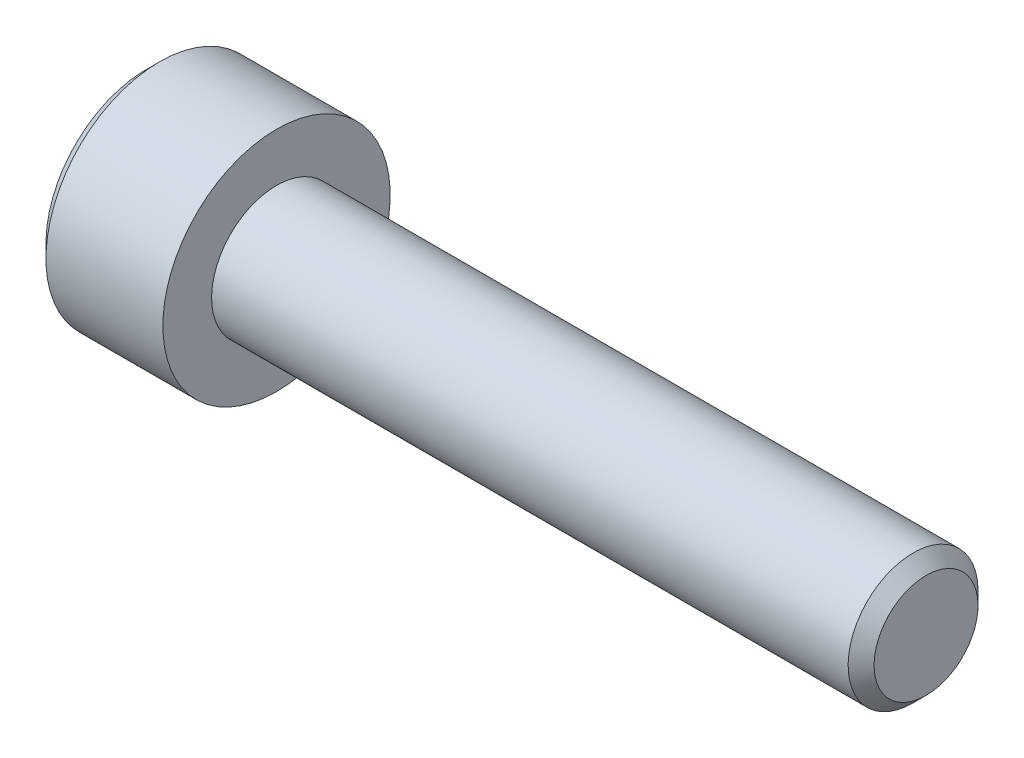
ISO-10303-21;
HEADER;
FILE_DESCRIPTION(('STEP AP214'),'2;1');
FILE_NAME('part.step','',(''),(''),'','','');
FILE_SCHEMA(('AUTOMOTIVE_DESIGN { 1 0 10303 214 1 1 1 1 }'));
ENDSEC;
DATA;
#1=APPLICATION_CONTEXT('core data for automotive mechanical design processes');
#2=APPLICATION_PROTOCOL_DEFINITION('international standard','automotive_design',2000,#1);
#3=PRODUCT_CONTEXT('',#1,'mechanical');
#4=PRODUCT('Part','Part','',(#3));
#5=PRODUCT_RELATED_PRODUCT_CATEGORY('part','',(#4));
#6=PRODUCT_DEFINITION_FORMATION('','',#4);
#7=PRODUCT_DEFINITION_CONTEXT('part definition',#1,'design');
#8=PRODUCT_DEFINITION('design','',#6,#7);
#9=PRODUCT_DEFINITION_SHAPE('','',#8);
#10=(LENGTH_UNIT() NAMED_UNIT(*) SI_UNIT(.MILLI.,.METRE.));
#11=(NAMED_UNIT(*) PLANE_ANGLE_UNIT() SI_UNIT($,.RADIAN.));
#12=(NAMED_UNIT(*) SI_UNIT($,.STERADIAN.) SOLID_ANGLE_UNIT());
#13=UNCERTAINTY_MEASURE_WITH_UNIT(LENGTH_MEASURE(1.E-05),#10,'distance_accuracy_value','');
#14=(GEOMETRIC_REPRESENTATION_CONTEXT(3) GLOBAL_UNCERTAINTY_ASSIGNED_CONTEXT((#13)) GLOBAL_UNIT_ASSIGNED_CONTEXT((#10,
#11,#12)) REPRESENTATION_CONTEXT('',''));
#15=CARTESIAN_POINT('',(0.,0.,0.));
#16=DIRECTION('',(0.,0.,1.));
#17=DIRECTION('',(1.,0.,0.));
#18=AXIS2_PLACEMENT_3D('',#15,#16,#17);
#19=CARTESIAN_POINT('',(-4.,0.,0.));
#20=DIRECTION('',(1.,0.,0.));
#21=DIRECTION('',(0.,1.,0.));
#22=AXIS2_PLACEMENT_3D('',#19,#20,#21);
#23=PLANE('',#22);
#24=CARTESIAN_POINT('',(-4.,0.,0.));
#25=DIRECTION('',(-1.,0.,0.));
#26=DIRECTION('',(0.,-1.,0.));
#27=AXIS2_PLACEMENT_3D('',#24,#25,#26);
#28=CIRCLE('',#27,3.1);
#29=CARTESIAN_POINT('',(-4.,-3.1,0.));
#30=VERTEX_POINT('',#29);
#31=EDGE_CURVE('E156',#30,#30,#28,.T.);
#32=ORIENTED_EDGE('',*,*,#31,.T.);
#33=EDGE_LOOP('',(#32));
#34=FACE_BOUND('',#33,.T.);
#35=DIRECTION('',(0.,-0.500000000000009,-0.866025403784433));
#36=VECTOR('',#35,1.);
#37=CARTESIAN_POINT('',(-4.,-0.86602540378444,1.5));
#38=LINE('',#37,#36);
#39=CARTESIAN_POINT('',(-4.,-0.86602540378444,1.5));
#40=VERTEX_POINT('',#39);
#41=CARTESIAN_POINT('',(-4.,-1.7320508075689,0.));
#42=VERTEX_POINT('',#41);
#43=EDGE_CURVE('E272',#40,#42,#38,.T.);
#44=ORIENTED_EDGE('',*,*,#43,.T.);
#45=DIRECTION('',(0.,0.500000000000009,-0.866025403784433));
#46=VECTOR('',#45,1.);
#47=CARTESIAN_POINT('',(-4.,-1.7320508075689,0.));
#48=LINE('',#47,#46);
#49=CARTESIAN_POINT('',(-4.,-0.86602540378444,-1.5));
#50=VERTEX_POINT('',#49);
#51=EDGE_CURVE('E274',#42,#50,#48,.T.);
#52=ORIENTED_EDGE('',*,*,#51,.T.);
#53=DIRECTION('',(0.,1.,0.));
#54=VECTOR('',#53,1.);
#55=CARTESIAN_POINT('',(-4.,-0.86602540378444,-1.5));
#56=LINE('',#55,#54);
#57=CARTESIAN_POINT('',(-4.,0.86602540378444,-1.5));
#58=VERTEX_POINT('',#57);
#59=EDGE_CURVE('E276',#50,#58,#56,.T.);
#60=ORIENTED_EDGE('',*,*,#59,.T.);
#61=DIRECTION('',(0.,0.500000000000009,0.866025403784433));
#62=VECTOR('',#61,1.);
#63=CARTESIAN_POINT('',(-4.,0.86602540378444,-1.5));
#64=LINE('',#63,#62);
#65=CARTESIAN_POINT('',(-4.,1.7320508075689,0.));
#66=VERTEX_POINT('',#65);
#67=EDGE_CURVE('E121',#58,#66,#64,.T.);
#68=ORIENTED_EDGE('',*,*,#67,.T.);
#69=DIRECTION('',(0.,-0.500000000000009,0.866025403784433));
#70=VECTOR('',#69,1.);
#71=CARTESIAN_POINT('',(-4.,1.7320508075689,0.));
#72=LINE('',#71,#70);
#73=CARTESIAN_POINT('',(-4.,0.86602540378444,1.5));
#74=VERTEX_POINT('',#73);
#75=EDGE_CURVE('E269',#66,#74,#72,.T.);
#76=ORIENTED_EDGE('',*,*,#75,.T.);
#77=DIRECTION('',(0.,-1.,0.));
#78=VECTOR('',#77,1.);
#79=CARTESIAN_POINT('',(-4.,0.86602540378444,1.5));
#80=LINE('',#79,#78);
#81=EDGE_CURVE('E136',#74,#40,#80,.T.);
#82=ORIENTED_EDGE('',*,*,#81,.T.);
#83=EDGE_LOOP('',(#44,#52,#60,#68,#76,#82));
#84=FACE_BOUND('',#83,.T.);
#85=ADVANCED_FACE('F37',(#34,#84),#23,.F.);
#86=CARTESIAN_POINT('',(-3.6,0.,0.));
#87=DIRECTION('',(1.,0.,0.));
#88=DIRECTION('',(0.,1.,0.));
#89=AXIS2_PLACEMENT_3D('',#86,#87,#88);
#90=CONICAL_SURFACE('',#89,3.5,0.785398163397447);
#91=ORIENTED_EDGE('',*,*,#31,.F.);
#92=EDGE_LOOP('',(#91));
#93=FACE_BOUND('',#92,.T.);
#94=CARTESIAN_POINT('',(-3.6,0.,0.));
#95=DIRECTION('',(-1.,0.,0.));
#96=DIRECTION('',(0.,-1.,0.));
#97=AXIS2_PLACEMENT_3D('',#94,#95,#96);
#98=CIRCLE('',#97,3.5);
#99=CARTESIAN_POINT('',(-3.6,-3.5,0.));
#100=VERTEX_POINT('',#99);
#101=EDGE_CURVE('E153',#100,#100,#98,.T.);
#102=ORIENTED_EDGE('',*,*,#101,.T.);
#103=EDGE_LOOP('',(#102));
#104=FACE_BOUND('',#103,.T.);
#105=ADVANCED_FACE('F176',(#93,#104),#90,.T.);
#106=CARTESIAN_POINT('',(20.,0.,0.));
#107=DIRECTION('',(-1.,0.,0.));
#108=DIRECTION('',(0.,-1.,0.));
#109=AXIS2_PLACEMENT_3D('',#106,#107,#108);
#110=CYLINDRICAL_SURFACE('',#109,3.5);
#111=ORIENTED_EDGE('',*,*,#101,.F.);
#112=EDGE_LOOP('',(#111));
#113=FACE_BOUND('',#112,.T.);
#114=CARTESIAN_POINT('',(0.,0.,0.));
#115=DIRECTION('',(-1.,0.,0.));
#116=DIRECTION('',(0.,-1.,0.));
#117=AXIS2_PLACEMENT_3D('',#114,#115,#116);
#118=CIRCLE('',#117,3.5);
#119=CARTESIAN_POINT('',(0.,-3.5,0.));
#120=VERTEX_POINT('',#119);
#121=EDGE_CURVE('E150',#120,#120,#118,.T.);
#122=ORIENTED_EDGE('',*,*,#121,.T.);
#123=EDGE_LOOP('',(#122));
#124=FACE_BOUND('',#123,.T.);
#125=ADVANCED_FACE('F181',(#113,#124),#110,.T.);
#126=CARTESIAN_POINT('',(0.,3.5,0.));
#127=DIRECTION('',(-1.,0.,0.));
#128=DIRECTION('',(0.,-1.,0.));
#129=AXIS2_PLACEMENT_3D('',#126,#127,#128);
#130=PLANE('',#129);
#131=ORIENTED_EDGE('',*,*,#121,.F.);
#132=EDGE_LOOP('',(#131));
#133=FACE_BOUND('',#132,.T.);
#134=CARTESIAN_POINT('',(0.,0.,0.));
#135=DIRECTION('',(-1.,0.,0.));
#136=DIRECTION('',(0.,-1.,0.));
#137=AXIS2_PLACEMENT_3D('',#134,#135,#136);
#138=CIRCLE('',#137,2.);
#139=CARTESIAN_POINT('',(0.,-2.,0.));
#140=VERTEX_POINT('',#139);
#141=EDGE_CURVE('E146',#140,#140,#138,.T.);
#142=ORIENTED_EDGE('',*,*,#141,.T.);
#143=EDGE_LOOP('',(#142));
#144=FACE_BOUND('',#143,.T.);
#145=ADVANCED_FACE('F188',(#133,#144),#130,.F.);
#146=CARTESIAN_POINT('',(20.,0.,0.));
#147=DIRECTION('',(-1.,0.,0.));
#148=DIRECTION('',(0.,-1.,0.));
#149=AXIS2_PLACEMENT_3D('',#146,#147,#148);
#150=CYLINDRICAL_SURFACE('',#149,2.);
#151=CARTESIAN_POINT('',(19.6,0.,0.));
#152=DIRECTION('',(-1.,0.,0.));
#153=DIRECTION('',(0.,-1.,0.));
#154=AXIS2_PLACEMENT_3D('',#151,#152,#153);
#155=CIRCLE('',#154,2.);
#156=CARTESIAN_POINT('',(19.6,-2.,0.));
#157=VERTEX_POINT('',#156);
#158=EDGE_CURVE('E45',#157,#157,#155,.T.);
#159=ORIENTED_EDGE('',*,*,#158,.T.);
#160=EDGE_LOOP('',(#159));
#161=FACE_BOUND('',#160,.T.);
#162=ORIENTED_EDGE('',*,*,#141,.F.);
#163=EDGE_LOOP('',(#162));
#164=FACE_BOUND('',#163,.T.);
#165=ADVANCED_FACE('F161',(#161,#164),#150,.T.);
#166=CARTESIAN_POINT('',(20.,2.,0.));
#167=DIRECTION('',(-1.,0.,0.));
#168=DIRECTION('',(0.,-1.,0.));
#169=AXIS2_PLACEMENT_3D('',#166,#167,#168);
#170=PLANE('',#169);
#171=CARTESIAN_POINT('',(20.,0.,0.));
#172=DIRECTION('',(-1.,0.,0.));
#173=DIRECTION('',(0.,-1.,0.));
#174=AXIS2_PLACEMENT_3D('',#171,#172,#173);
#175=CIRCLE('',#174,1.59999999999999);
#176=CARTESIAN_POINT('',(20.,-1.59999999999999,0.));
#177=VERTEX_POINT('',#176);
#178=EDGE_CURVE('E11',#177,#177,#175,.F.);
#179=ORIENTED_EDGE('',*,*,#178,.T.);
#180=EDGE_LOOP('',(#179));
#181=FACE_BOUND('',#180,.T.);
#182=ADVANCED_FACE('F165',(#181),#170,.F.);
#183=CARTESIAN_POINT('',(19.6,0.,0.));
#184=DIRECTION('',(-1.,0.,0.));
#185=DIRECTION('',(0.,-1.,0.));
#186=AXIS2_PLACEMENT_3D('',#183,#184,#185);
#187=CONICAL_SURFACE('',#186,2.,0.785398163397449);
#188=ORIENTED_EDGE('',*,*,#178,.F.);
#189=EDGE_LOOP('',(#188));
#190=FACE_BOUND('',#189,.T.);
#191=ORIENTED_EDGE('',*,*,#158,.F.);
#192=EDGE_LOOP('',(#191));
#193=FACE_BOUND('',#192,.T.);
#194=ADVANCED_FACE('F39',(#190,#193),#187,.T.);
#195=CARTESIAN_POINT('',(-2.,1.7320508075689,0.));
#196=DIRECTION('',(0.,-0.866025403784433,-0.500000000000009));
#197=DIRECTION('',(0.,0.500000000000009,-0.866025403784433));
#198=AXIS2_PLACEMENT_3D('',#195,#196,#197);
#199=PLANE('',#198);
#200=DIRECTION('',(0.,-0.500000000000009,0.866025403784433));
#201=VECTOR('',#200,1.);
#202=CARTESIAN_POINT('',(-2.,1.7320508075689,0.));
#203=LINE('',#202,#201);
#204=CARTESIAN_POINT('',(-2.,1.7320508075689,0.));
#205=VERTEX_POINT('',#204);
#206=CARTESIAN_POINT('',(-2.,1.29903810567666,0.750000000000019));
#207=VERTEX_POINT('',#206);
#208=EDGE_CURVE('E118',#205,#207,#203,.T.);
#209=ORIENTED_EDGE('',*,*,#208,.T.);
#210=CARTESIAN_POINT('',(-2.,0.86602540378444,1.5));
#211=VERTEX_POINT('',#210);
#212=EDGE_CURVE('E110',#207,#211,#203,.T.);
#213=ORIENTED_EDGE('',*,*,#212,.T.);
#214=DIRECTION('',(-1.,0.,0.));
#215=VECTOR('',#214,1.);
#216=CARTESIAN_POINT('',(-2.,0.86602540378444,1.5));
#217=LINE('',#216,#215);
#218=EDGE_CURVE('E115',#211,#74,#217,.T.);
#219=ORIENTED_EDGE('',*,*,#218,.T.);
#220=ORIENTED_EDGE('',*,*,#75,.F.);
#221=DIRECTION('',(-1.,0.,0.));
#222=VECTOR('',#221,1.);
#223=CARTESIAN_POINT('',(-2.,1.7320508075689,0.));
#224=LINE('',#223,#222);
#225=EDGE_CURVE('E253',#205,#66,#224,.T.);
#226=ORIENTED_EDGE('',*,*,#225,.F.);
#227=EDGE_LOOP('',(#209,#213,#219,#220,#226));
#228=FACE_BOUND('',#227,.T.);
#229=ADVANCED_FACE('F112',(#228),#199,.T.);
#230=CARTESIAN_POINT('',(-2.,0.86602540378444,1.5));
#231=DIRECTION('',(0.,0.,-1.));
#232=DIRECTION('',(-1.,0.,0.));
#233=AXIS2_PLACEMENT_3D('',#230,#231,#232);
#234=PLANE('',#233);
#235=DIRECTION('',(0.,-1.,0.));
#236=VECTOR('',#235,1.);
#237=CARTESIAN_POINT('',(-2.,0.86602540378444,1.5));
#238=LINE('',#237,#236);
#239=CARTESIAN_POINT('',(-2.,0.,1.5));
#240=VERTEX_POINT('',#239);
#241=EDGE_CURVE('E124',#211,#240,#238,.T.);
#242=ORIENTED_EDGE('',*,*,#241,.T.);
#243=CARTESIAN_POINT('',(-2.,-0.86602540378444,1.5));
#244=VERTEX_POINT('',#243);
#245=EDGE_CURVE('E131',#240,#244,#238,.T.);
#246=ORIENTED_EDGE('',*,*,#245,.T.);
#247=DIRECTION('',(-1.,0.,0.));
#248=VECTOR('',#247,1.);
#249=CARTESIAN_POINT('',(-2.,-0.86602540378444,1.5));
#250=LINE('',#249,#248);
#251=EDGE_CURVE('E138',#244,#40,#250,.T.);
#252=ORIENTED_EDGE('',*,*,#251,.T.);
#253=ORIENTED_EDGE('',*,*,#81,.F.);
#254=ORIENTED_EDGE('',*,*,#218,.F.);
#255=EDGE_LOOP('',(#242,#246,#252,#253,#254));
#256=FACE_BOUND('',#255,.T.);
#257=ADVANCED_FACE('F134',(#256),#234,.T.);
#258=CARTESIAN_POINT('',(-2.,-0.86602540378444,1.5));
#259=DIRECTION('',(0.,0.866025403784433,-0.500000000000009));
#260=DIRECTION('',(0.,0.500000000000009,0.866025403784433));
#261=AXIS2_PLACEMENT_3D('',#258,#259,#260);
#262=PLANE('',#261);
#263=DIRECTION('',(0.,-0.500000000000009,-0.866025403784433));
#264=VECTOR('',#263,1.);
#265=CARTESIAN_POINT('',(-2.,-0.86602540378444,1.5));
#266=LINE('',#265,#264);
#267=CARTESIAN_POINT('',(-2.,-1.29903810567666,0.750000000000019));
#268=VERTEX_POINT('',#267);
#269=EDGE_CURVE('E260',#244,#268,#266,.T.);
#270=ORIENTED_EDGE('',*,*,#269,.T.);
#271=CARTESIAN_POINT('',(-2.,-1.7320508075689,0.));
#272=VERTEX_POINT('',#271);
#273=EDGE_CURVE('E130',#268,#272,#266,.T.);
#274=ORIENTED_EDGE('',*,*,#273,.T.);
#275=DIRECTION('',(-1.,0.,0.));
#276=VECTOR('',#275,1.);
#277=CARTESIAN_POINT('',(-2.,-1.7320508075689,0.));
#278=LINE('',#277,#276);
#279=EDGE_CURVE('E142',#272,#42,#278,.T.);
#280=ORIENTED_EDGE('',*,*,#279,.T.);
#281=ORIENTED_EDGE('',*,*,#43,.F.);
#282=ORIENTED_EDGE('',*,*,#251,.F.);
#283=EDGE_LOOP('',(#270,#274,#280,#281,#282));
#284=FACE_BOUND('',#283,.T.);
#285=ADVANCED_FACE('F202',(#284),#262,.T.);
#286=CARTESIAN_POINT('',(-2.,-1.7320508075689,0.));
#287=DIRECTION('',(0.,0.866025403784433,0.500000000000009));
#288=DIRECTION('',(0.,-0.500000000000009,0.866025403784433));
#289=AXIS2_PLACEMENT_3D('',#286,#287,#288);
#290=PLANE('',#289);
#291=DIRECTION('',(0.,0.500000000000009,-0.866025403784433));
#292=VECTOR('',#291,1.);
#293=CARTESIAN_POINT('',(-2.,-1.7320508075689,0.));
#294=LINE('',#293,#292);
#295=CARTESIAN_POINT('',(-2.,-1.29903810567665,-0.750000000000014));
#296=VERTEX_POINT('',#295);
#297=EDGE_CURVE('E52',#272,#296,#294,.T.);
#298=ORIENTED_EDGE('',*,*,#297,.T.);
#299=CARTESIAN_POINT('',(-2.,-0.86602540378444,-1.5));
#300=VERTEX_POINT('',#299);
#301=EDGE_CURVE('E265',#296,#300,#294,.T.);
#302=ORIENTED_EDGE('',*,*,#301,.T.);
#303=DIRECTION('',(-1.,0.,0.));
#304=VECTOR('',#303,1.);
#305=CARTESIAN_POINT('',(-2.,-0.86602540378444,-1.5));
#306=LINE('',#305,#304);
#307=EDGE_CURVE('E281',#300,#50,#306,.T.);
#308=ORIENTED_EDGE('',*,*,#307,.T.);
#309=ORIENTED_EDGE('',*,*,#51,.F.);
#310=ORIENTED_EDGE('',*,*,#279,.F.);
#311=EDGE_LOOP('',(#298,#302,#308,#309,#310));
#312=FACE_BOUND('',#311,.T.);
#313=ADVANCED_FACE('F205',(#312),#290,.T.);
#314=CARTESIAN_POINT('',(-2.,-0.86602540378444,-1.5));
#315=DIRECTION('',(0.,0.,1.));
#316=DIRECTION('',(1.,0.,0.));
#317=AXIS2_PLACEMENT_3D('',#314,#315,#316);
#318=PLANE('',#317);
#319=DIRECTION('',(0.,1.,0.));
#320=VECTOR('',#319,1.);
#321=CARTESIAN_POINT('',(-2.,-0.86602540378444,-1.5));
#322=LINE('',#321,#320);
#323=CARTESIAN_POINT('',(-2.,0.,-1.5));
#324=VERTEX_POINT('',#323);
#325=EDGE_CURVE('E247',#300,#324,#322,.T.);
#326=ORIENTED_EDGE('',*,*,#325,.T.);
#327=CARTESIAN_POINT('',(-2.,0.86602540378444,-1.5));
#328=VERTEX_POINT('',#327);
#329=EDGE_CURVE('E240',#324,#328,#322,.T.);
#330=ORIENTED_EDGE('',*,*,#329,.T.);
#331=DIRECTION('',(-1.,0.,0.));
#332=VECTOR('',#331,1.);
#333=CARTESIAN_POINT('',(-2.,0.86602540378444,-1.5));
#334=LINE('',#333,#332);
#335=EDGE_CURVE('E252',#328,#58,#334,.T.);
#336=ORIENTED_EDGE('',*,*,#335,.T.);
#337=ORIENTED_EDGE('',*,*,#59,.F.);
#338=ORIENTED_EDGE('',*,*,#307,.F.);
#339=EDGE_LOOP('',(#326,#330,#336,#337,#338));
#340=FACE_BOUND('',#339,.T.);
#341=ADVANCED_FACE('F209',(#340),#318,.T.);
#342=CARTESIAN_POINT('',(-2.,0.86602540378444,-1.5));
#343=DIRECTION('',(0.,-0.866025403784433,0.500000000000009));
#344=DIRECTION('',(0.,-0.500000000000009,-0.866025403784433));
#345=AXIS2_PLACEMENT_3D('',#342,#343,#344);
#346=PLANE('',#345);
#347=DIRECTION('',(0.,0.500000000000009,0.866025403784433));
#348=VECTOR('',#347,1.);
#349=CARTESIAN_POINT('',(-2.,0.86602540378444,-1.5));
#350=LINE('',#349,#348);
#351=CARTESIAN_POINT('',(-2.,1.29903810567666,-0.750000000000019));
#352=VERTEX_POINT('',#351);
#353=EDGE_CURVE('E239',#328,#352,#350,.T.);
#354=ORIENTED_EDGE('',*,*,#353,.T.);
#355=EDGE_CURVE('E245',#352,#205,#350,.T.);
#356=ORIENTED_EDGE('',*,*,#355,.T.);
#357=ORIENTED_EDGE('',*,*,#225,.T.);
#358=ORIENTED_EDGE('',*,*,#67,.F.);
#359=ORIENTED_EDGE('',*,*,#335,.F.);
#360=EDGE_LOOP('',(#354,#356,#357,#358,#359));
#361=FACE_BOUND('',#360,.T.);
#362=ADVANCED_FACE('F212',(#361),#346,.T.);
#363=CARTESIAN_POINT('',(-2.,0.86602540378444,1.5));
#364=DIRECTION('',(1.,0.,0.));
#365=DIRECTION('',(0.,0.,-1.));
#366=AXIS2_PLACEMENT_3D('',#363,#364,#365);
#367=PLANE('',#366);
#368=CARTESIAN_POINT('',(-2.,0.,0.));
#369=DIRECTION('',(-1.,0.,0.));
#370=DIRECTION('',(0.,0.,1.));
#371=AXIS2_PLACEMENT_3D('',#368,#369,#370);
#372=CIRCLE('',#371,1.5);
#373=EDGE_CURVE('E236',#352,#324,#372,.T.);
#374=ORIENTED_EDGE('',*,*,#373,.F.);
#375=ORIENTED_EDGE('',*,*,#353,.F.);
#376=ORIENTED_EDGE('',*,*,#329,.F.);
#377=EDGE_LOOP('',(#374,#375,#376));
#378=FACE_BOUND('',#377,.T.);
#379=ADVANCED_FACE('F216',(#378),#367,.F.);
#380=EDGE_CURVE('E147',#207,#352,#372,.T.);
#381=ORIENTED_EDGE('',*,*,#380,.F.);
#382=ORIENTED_EDGE('',*,*,#208,.F.);
#383=ORIENTED_EDGE('',*,*,#355,.F.);
#384=EDGE_LOOP('',(#381,#382,#383));
#385=FACE_BOUND('',#384,.T.);
#386=ADVANCED_FACE('F227',(#385),#367,.F.);
#387=EDGE_CURVE('E126',#240,#207,#372,.T.);
#388=ORIENTED_EDGE('',*,*,#387,.F.);
#389=ORIENTED_EDGE('',*,*,#241,.F.);
#390=ORIENTED_EDGE('',*,*,#212,.F.);
#391=EDGE_LOOP('',(#388,#389,#390));
#392=FACE_BOUND('',#391,.T.);
#393=ADVANCED_FACE('F125',(#392),#367,.F.);
#394=EDGE_CURVE('E137',#268,#240,#372,.T.);
#395=ORIENTED_EDGE('',*,*,#394,.F.);
#396=ORIENTED_EDGE('',*,*,#269,.F.);
#397=ORIENTED_EDGE('',*,*,#245,.F.);
#398=EDGE_LOOP('',(#395,#396,#397));
#399=FACE_BOUND('',#398,.T.);
#400=ADVANCED_FACE('F224',(#399),#367,.F.);
#401=EDGE_CURVE('E140',#296,#268,#372,.T.);
#402=ORIENTED_EDGE('',*,*,#401,.F.);
#403=ORIENTED_EDGE('',*,*,#297,.F.);
#404=ORIENTED_EDGE('',*,*,#273,.F.);
#405=EDGE_LOOP('',(#402,#403,#404));
#406=FACE_BOUND('',#405,.T.);
#407=ADVANCED_FACE('F219',(#406),#367,.F.);
#408=EDGE_CURVE('E244',#324,#296,#372,.T.);
#409=ORIENTED_EDGE('',*,*,#408,.F.);
#410=ORIENTED_EDGE('',*,*,#325,.F.);
#411=ORIENTED_EDGE('',*,*,#301,.F.);
#412=EDGE_LOOP('',(#409,#410,#411));
#413=FACE_BOUND('',#412,.T.);
#414=ADVANCED_FACE('F197',(#413),#367,.F.);
#415=CARTESIAN_POINT('',(-1.5980762113533,0.,0.));
#416=DIRECTION('',(-1.,0.,0.));
#417=DIRECTION('',(0.,0.,1.));
#418=AXIS2_PLACEMENT_3D('',#415,#416,#417);
#419=CONICAL_SURFACE('',#418,0.,1.30899693899574);
#420=ORIENTED_EDGE('',*,*,#387,.T.);
#421=ORIENTED_EDGE('',*,*,#380,.T.);
#422=ORIENTED_EDGE('',*,*,#373,.T.);
#423=ORIENTED_EDGE('',*,*,#408,.T.);
#424=ORIENTED_EDGE('',*,*,#401,.T.);
#425=ORIENTED_EDGE('',*,*,#394,.T.);
#426=EDGE_LOOP('',(#420,#421,#422,#423,#424,#425));
#427=FACE_BOUND('',#426,.T.);
#428=CARTESIAN_POINT('',(-1.5980762113533,0.,0.));
#429=VERTEX_POINT('',#428);
#430=VERTEX_LOOP('',#429);
#431=FACE_BOUND('',#430,.T.);
#432=ADVANCED_FACE('F195',(#427,#431),#419,.F.);
#433=CLOSED_SHELL('',(#85,#105,#125,#145,#165,#182,#194,#229,#257,#285,#313,#341,#362,#379,#386,
#393,#400,#407,#414,#432));
#434=MANIFOLD_SOLID_BREP('B2',#433);
#435=ADVANCED_BREP_SHAPE_REPRESENTATION('',(#18,#434),#14);
#436=SHAPE_DEFINITION_REPRESENTATION(#9,#435);
ENDSEC;
END-ISO-10303-21;
